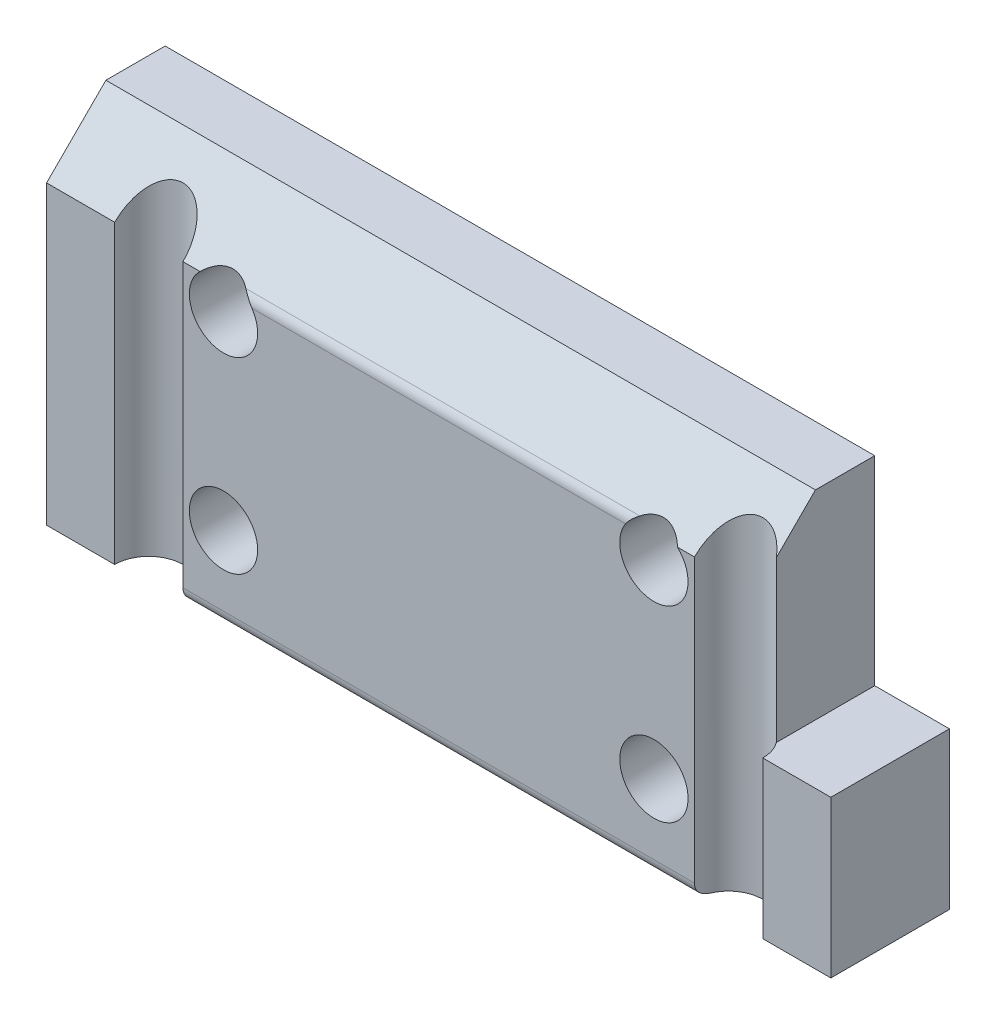
ISO-10303-21;
HEADER;
FILE_DESCRIPTION(('STEP AP214'),'2;1');
FILE_NAME('part.step','',(''),(''),'','','');
FILE_SCHEMA(('AUTOMOTIVE_DESIGN { 1 0 10303 214 1 1 1 1 }'));
ENDSEC;
DATA;
#1=APPLICATION_CONTEXT('core data for automotive mechanical design processes');
#2=APPLICATION_PROTOCOL_DEFINITION('international standard','automotive_design',2000,#1);
#3=PRODUCT_CONTEXT('',#1,'mechanical');
#4=PRODUCT('Part','Part','',(#3));
#5=PRODUCT_RELATED_PRODUCT_CATEGORY('part','',(#4));
#6=PRODUCT_DEFINITION_FORMATION('','',#4);
#7=PRODUCT_DEFINITION_CONTEXT('part definition',#1,'design');
#8=PRODUCT_DEFINITION('design','',#6,#7);
#9=PRODUCT_DEFINITION_SHAPE('','',#8);
#10=(LENGTH_UNIT() NAMED_UNIT(*) SI_UNIT(.MILLI.,.METRE.));
#11=(NAMED_UNIT(*) PLANE_ANGLE_UNIT() SI_UNIT($,.RADIAN.));
#12=(NAMED_UNIT(*) SI_UNIT($,.STERADIAN.) SOLID_ANGLE_UNIT());
#13=UNCERTAINTY_MEASURE_WITH_UNIT(LENGTH_MEASURE(1.E-05),#10,'distance_accuracy_value','');
#14=(GEOMETRIC_REPRESENTATION_CONTEXT(3) GLOBAL_UNCERTAINTY_ASSIGNED_CONTEXT((#13)) GLOBAL_UNIT_ASSIGNED_CONTEXT((#10,
#11,#12)) REPRESENTATION_CONTEXT('',''));
#15=CARTESIAN_POINT('',(0.,0.,0.));
#16=DIRECTION('',(0.,0.,1.));
#17=DIRECTION('',(1.,0.,0.));
#18=AXIS2_PLACEMENT_3D('',#15,#16,#17);
#19=CARTESIAN_POINT('',(21.,6.34999999999997,0.));
#20=DIRECTION('',(0.,0.,-1.));
#21=DIRECTION('',(0.,1.,0.));
#22=AXIS2_PLACEMENT_3D('',#19,#20,#21);
#23=PLANE('',#22);
#24=DIRECTION('',(0.,-1.,0.));
#25=VECTOR('',#24,1.);
#26=CARTESIAN_POINT('',(21.,6.34999999999997,0.));
#27=LINE('',#26,#25);
#28=CARTESIAN_POINT('',(21.,-1.143,0.));
#29=VERTEX_POINT('',#28);
#30=CARTESIAN_POINT('',(21.,-9.525,0.));
#31=VERTEX_POINT('',#30);
#32=EDGE_CURVE('E166',#29,#31,#27,.T.);
#33=ORIENTED_EDGE('',*,*,#32,.F.);
#34=DIRECTION('',(-1.,0.,0.));
#35=VECTOR('',#34,1.);
#36=CARTESIAN_POINT('',(21.,-1.143,0.));
#37=LINE('',#36,#35);
#38=CARTESIAN_POINT('',(17.3538,-1.143,0.));
#39=VERTEX_POINT('',#38);
#40=EDGE_CURVE('E152',#29,#39,#37,.T.);
#41=ORIENTED_EDGE('',*,*,#40,.T.);
#42=DIRECTION('',(0.,-1.,0.));
#43=VECTOR('',#42,1.);
#44=CARTESIAN_POINT('',(17.3538,-9.525,0.));
#45=LINE('',#44,#43);
#46=CARTESIAN_POINT('',(17.3538,-9.525,0.));
#47=VERTEX_POINT('',#46);
#48=EDGE_CURVE('E411',#39,#47,#45,.T.);
#49=ORIENTED_EDGE('',*,*,#48,.T.);
#50=DIRECTION('',(-1.,0.,0.));
#51=VECTOR('',#50,1.);
#52=CARTESIAN_POINT('',(21.,-9.525,0.));
#53=LINE('',#52,#51);
#54=EDGE_CURVE('E172',#31,#47,#53,.T.);
#55=ORIENTED_EDGE('',*,*,#54,.F.);
#56=EDGE_LOOP('',(#33,#41,#49,#55));
#57=FACE_BOUND('',#56,.T.);
#58=ADVANCED_FACE('F45',(#57),#23,.F.);
#59=CARTESIAN_POINT('',(-11.525,-5.025,0.));
#60=DIRECTION('',(0.,0.,-1.));
#61=DIRECTION('',(0.,1.,0.));
#62=AXIS2_PLACEMENT_3D('',#59,#60,#61);
#63=CIRCLE('',#62,1.8288);
#64=CARTESIAN_POINT('',(-11.525,-3.1962,0.));
#65=VERTEX_POINT('',#64);
#66=EDGE_CURVE('E186',#65,#65,#63,.T.);
#67=ORIENTED_EDGE('',*,*,#66,.T.);
#68=EDGE_LOOP('',(#67));
#69=FACE_BOUND('',#68,.T.);
#70=CARTESIAN_POINT('',(11.525,-5.025,0.));
#71=DIRECTION('',(0.,0.,-1.));
#72=DIRECTION('',(0.,1.,0.));
#73=AXIS2_PLACEMENT_3D('',#70,#71,#72);
#74=CIRCLE('',#73,1.8288);
#75=CARTESIAN_POINT('',(11.525,-3.1962,0.));
#76=VERTEX_POINT('',#75);
#77=EDGE_CURVE('E216',#76,#76,#74,.T.);
#78=ORIENTED_EDGE('',*,*,#77,.T.);
#79=EDGE_LOOP('',(#78));
#80=FACE_BOUND('',#79,.T.);
#81=CARTESIAN_POINT('',(11.525,5.025,0.));
#82=DIRECTION('',(0.,0.,-1.));
#83=DIRECTION('',(0.,1.,0.));
#84=AXIS2_PLACEMENT_3D('',#81,#82,#83);
#85=CIRCLE('',#84,1.8288);
#86=CARTESIAN_POINT('',(12.7855095953622,6.34999999999997,0.));
#87=VERTEX_POINT('',#86);
#88=CARTESIAN_POINT('',(10.003282498988,6.03933982822015,0.));
#89=VERTEX_POINT('',#88);
#90=EDGE_CURVE('E437',#87,#89,#85,.T.);
#91=ORIENTED_EDGE('',*,*,#90,.T.);
#92=DIRECTION('',(-1.,0.,0.));
#93=VECTOR('',#92,1.);
#94=CARTESIAN_POINT('',(21.,6.03933982822015,0.));
#95=LINE('',#94,#93);
#96=CARTESIAN_POINT('',(-10.003282498988,6.03933982822015,0.));
#97=VERTEX_POINT('',#96);
#98=EDGE_CURVE('E229',#89,#97,#95,.T.);
#99=ORIENTED_EDGE('',*,*,#98,.T.);
#100=CARTESIAN_POINT('',(-11.525,5.025,0.));
#101=DIRECTION('',(0.,0.,-1.));
#102=DIRECTION('',(0.,1.,0.));
#103=AXIS2_PLACEMENT_3D('',#100,#101,#102);
#104=CIRCLE('',#103,1.8288);
#105=CARTESIAN_POINT('',(-12.7855095953621,6.34999999999997,0.));
#106=VERTEX_POINT('',#105);
#107=EDGE_CURVE('E456',#97,#106,#104,.T.);
#108=ORIENTED_EDGE('',*,*,#107,.T.);
#109=DIRECTION('',(-1.,0.,0.));
#110=VECTOR('',#109,1.);
#111=CARTESIAN_POINT('',(21.,6.34999999999997,0.));
#112=LINE('',#111,#110);
#113=CARTESIAN_POINT('',(-13.6962,6.34999999999997,0.));
#114=VERTEX_POINT('',#113);
#115=EDGE_CURVE('E205',#106,#114,#112,.T.);
#116=ORIENTED_EDGE('',*,*,#115,.T.);
#117=DIRECTION('',(0.,-1.,0.));
#118=VECTOR('',#117,1.);
#119=CARTESIAN_POINT('',(-13.6962,-9.525,0.));
#120=LINE('',#119,#118);
#121=CARTESIAN_POINT('',(-13.6962,-8.775,0.));
#122=VERTEX_POINT('',#121);
#123=EDGE_CURVE('E425',#114,#122,#120,.T.);
#124=ORIENTED_EDGE('',*,*,#123,.T.);
#125=DIRECTION('',(-1.,0.,0.));
#126=VECTOR('',#125,1.);
#127=CARTESIAN_POINT('',(21.,-8.775,0.));
#128=LINE('',#127,#126);
#129=CARTESIAN_POINT('',(13.6962,-8.775,0.));
#130=VERTEX_POINT('',#129);
#131=EDGE_CURVE('E227',#122,#130,#128,.F.);
#132=ORIENTED_EDGE('',*,*,#131,.T.);
#133=DIRECTION('',(0.,-1.,0.));
#134=VECTOR('',#133,1.);
#135=CARTESIAN_POINT('',(13.6962,-9.525,0.));
#136=LINE('',#135,#134);
#137=CARTESIAN_POINT('',(13.6962,6.34999999999997,0.));
#138=VERTEX_POINT('',#137);
#139=EDGE_CURVE('E415',#130,#138,#136,.F.);
#140=ORIENTED_EDGE('',*,*,#139,.T.);
#141=EDGE_CURVE('E201',#138,#87,#112,.T.);
#142=ORIENTED_EDGE('',*,*,#141,.T.);
#143=EDGE_LOOP('',(#91,#99,#108,#116,#124,#132,#140,#142));
#144=FACE_BOUND('',#143,.T.);
#145=ADVANCED_FACE('F279',(#69,#80,#144),#23,.F.);
#146=CARTESIAN_POINT('',(21.,9.525,-6.35));
#147=DIRECTION('',(0.,0.,1.));
#148=DIRECTION('',(1.,0.,0.));
#149=AXIS2_PLACEMENT_3D('',#146,#147,#148);
#150=PLANE('',#149);
#151=CARTESIAN_POINT('',(11.525,5.025,-6.35));
#152=DIRECTION('',(0.,0.,-1.));
#153=DIRECTION('',(-1.,0.,0.));
#154=AXIS2_PLACEMENT_3D('',#151,#152,#153);
#155=CIRCLE('',#154,3.57251);
#156=CARTESIAN_POINT('',(7.95249,5.025,-6.35));
#157=VERTEX_POINT('',#156);
#158=EDGE_CURVE('E428',#157,#157,#155,.T.);
#159=ORIENTED_EDGE('',*,*,#158,.F.);
#160=EDGE_LOOP('',(#159));
#161=FACE_BOUND('',#160,.T.);
#162=CARTESIAN_POINT('',(11.525,-5.025,-6.35));
#163=DIRECTION('',(0.,0.,-1.));
#164=DIRECTION('',(-1.,0.,0.));
#165=AXIS2_PLACEMENT_3D('',#162,#163,#164);
#166=CIRCLE('',#165,3.57251);
#167=CARTESIAN_POINT('',(7.95249,-5.025,-6.35));
#168=VERTEX_POINT('',#167);
#169=EDGE_CURVE('E440',#168,#168,#166,.T.);
#170=ORIENTED_EDGE('',*,*,#169,.F.);
#171=EDGE_LOOP('',(#170));
#172=FACE_BOUND('',#171,.T.);
#173=CARTESIAN_POINT('',(-11.525,5.025,-6.35));
#174=DIRECTION('',(0.,0.,-1.));
#175=DIRECTION('',(-1.,0.,0.));
#176=AXIS2_PLACEMENT_3D('',#173,#174,#175);
#177=CIRCLE('',#176,3.57251);
#178=CARTESIAN_POINT('',(-15.09751,5.025,-6.35));
#179=VERTEX_POINT('',#178);
#180=EDGE_CURVE('E219',#179,#179,#177,.T.);
#181=ORIENTED_EDGE('',*,*,#180,.F.);
#182=EDGE_LOOP('',(#181));
#183=FACE_BOUND('',#182,.T.);
#184=CARTESIAN_POINT('',(-11.525,-5.025,-6.35));
#185=DIRECTION('',(0.,0.,-1.));
#186=DIRECTION('',(-1.,0.,0.));
#187=AXIS2_PLACEMENT_3D('',#184,#185,#186);
#188=CIRCLE('',#187,3.57251);
#189=CARTESIAN_POINT('',(-15.09751,-5.025,-6.35));
#190=VERTEX_POINT('',#189);
#191=EDGE_CURVE('E458',#190,#190,#188,.T.);
#192=ORIENTED_EDGE('',*,*,#191,.F.);
#193=EDGE_LOOP('',(#192));
#194=FACE_BOUND('',#193,.T.);
#195=DIRECTION('',(-1.,0.,0.));
#196=VECTOR('',#195,1.);
#197=CARTESIAN_POINT('',(21.,9.525,-6.35));
#198=LINE('',#197,#196);
#199=CARTESIAN_POINT('',(17.,9.525,-6.35));
#200=VERTEX_POINT('',#199);
#201=CARTESIAN_POINT('',(-21.,9.525,-6.35));
#202=VERTEX_POINT('',#201);
#203=EDGE_CURVE('E207',#200,#202,#198,.T.);
#204=ORIENTED_EDGE('',*,*,#203,.F.);
#205=DIRECTION('',(0.,1.,0.));
#206=VECTOR('',#205,1.);
#207=CARTESIAN_POINT('',(17.,9.525,-6.35));
#208=LINE('',#207,#206);
#209=CARTESIAN_POINT('',(17.,-1.143,-6.35));
#210=VERTEX_POINT('',#209);
#211=EDGE_CURVE('E161',#210,#200,#208,.T.);
#212=ORIENTED_EDGE('',*,*,#211,.F.);
#213=DIRECTION('',(-1.,0.,0.));
#214=VECTOR('',#213,1.);
#215=CARTESIAN_POINT('',(21.,-1.143,-6.35));
#216=LINE('',#215,#214);
#217=CARTESIAN_POINT('',(21.,-1.143,-6.35));
#218=VERTEX_POINT('',#217);
#219=EDGE_CURVE('E491',#218,#210,#216,.T.);
#220=ORIENTED_EDGE('',*,*,#219,.F.);
#221=DIRECTION('',(0.,1.,0.));
#222=VECTOR('',#221,1.);
#223=CARTESIAN_POINT('',(21.,9.525,-6.35));
#224=LINE('',#223,#222);
#225=CARTESIAN_POINT('',(21.,-9.525,-6.35));
#226=VERTEX_POINT('',#225);
#227=EDGE_CURVE('E169',#226,#218,#224,.T.);
#228=ORIENTED_EDGE('',*,*,#227,.F.);
#229=DIRECTION('',(-1.,0.,0.));
#230=VECTOR('',#229,1.);
#231=CARTESIAN_POINT('',(21.,-9.525,-6.35));
#232=LINE('',#231,#230);
#233=CARTESIAN_POINT('',(-21.,-9.525,-6.35));
#234=VERTEX_POINT('',#233);
#235=EDGE_CURVE('E176',#226,#234,#232,.T.);
#236=ORIENTED_EDGE('',*,*,#235,.T.);
#237=DIRECTION('',(0.,1.,0.));
#238=VECTOR('',#237,1.);
#239=CARTESIAN_POINT('',(-21.,9.525,-6.35));
#240=LINE('',#239,#238);
#241=EDGE_CURVE('E182',#234,#202,#240,.T.);
#242=ORIENTED_EDGE('',*,*,#241,.T.);
#243=EDGE_LOOP('',(#204,#212,#220,#228,#236,#242));
#244=FACE_BOUND('',#243,.T.);
#245=ADVANCED_FACE('F285',(#161,#172,#183,#194,#244),#150,.F.);
#246=CARTESIAN_POINT('',(21.,9.525,-3.175));
#247=DIRECTION('',(0.,-1.,0.));
#248=DIRECTION('',(0.,0.,-1.));
#249=AXIS2_PLACEMENT_3D('',#246,#247,#248);
#250=PLANE('',#249);
#251=DIRECTION('',(-1.,0.,0.));
#252=VECTOR('',#251,1.);
#253=CARTESIAN_POINT('',(21.,9.525,-3.175));
#254=LINE('',#253,#252);
#255=CARTESIAN_POINT('',(17.,9.525,-3.175));
#256=VERTEX_POINT('',#255);
#257=CARTESIAN_POINT('',(-21.,9.525,-3.175));
#258=VERTEX_POINT('',#257);
#259=EDGE_CURVE('E204',#256,#258,#254,.T.);
#260=ORIENTED_EDGE('',*,*,#259,.F.);
#261=DIRECTION('',(0.,0.,-1.));
#262=VECTOR('',#261,1.);
#263=CARTESIAN_POINT('',(17.,9.525,0.));
#264=LINE('',#263,#262);
#265=EDGE_CURVE('E479',#256,#200,#264,.T.);
#266=ORIENTED_EDGE('',*,*,#265,.T.);
#267=ORIENTED_EDGE('',*,*,#203,.T.);
#268=DIRECTION('',(0.,0.,1.));
#269=VECTOR('',#268,1.);
#270=CARTESIAN_POINT('',(-21.,9.525,-3.175));
#271=LINE('',#270,#269);
#272=EDGE_CURVE('E185',#202,#258,#271,.T.);
#273=ORIENTED_EDGE('',*,*,#272,.T.);
#274=EDGE_LOOP('',(#260,#266,#267,#273));
#275=FACE_BOUND('',#274,.T.);
#276=ADVANCED_FACE('F282',(#275),#250,.F.);
#277=CARTESIAN_POINT('',(21.,6.34999999999997,0.));
#278=DIRECTION('',(0.,-0.707106781186544,-0.707106781186551));
#279=DIRECTION('',(0.,0.707106781186551,-0.707106781186544));
#280=AXIS2_PLACEMENT_3D('',#277,#278,#279);
#281=PLANE('',#280);
#282=CARTESIAN_POINT('',(15.525,6.34999999999997,0.));
#283=DIRECTION('',(0.,-0.707106781186544,-0.707106781186551));
#284=DIRECTION('',(0.,-0.707106781186551,0.707106781186544));
#285=AXIS2_PLACEMENT_3D('',#282,#283,#284);
#286=ELLIPSE('',#285,2.58631376286792,1.82879999999999);
#287=CARTESIAN_POINT('',(17.,7.43114959186966,-1.08114959186968));
#288=VERTEX_POINT('',#287);
#289=EDGE_CURVE('E224',#138,#288,#286,.T.);
#290=ORIENTED_EDGE('',*,*,#289,.T.);
#291=DIRECTION('',(0.,0.707106781186551,-0.707106781186544));
#292=VECTOR('',#291,1.);
#293=CARTESIAN_POINT('',(17.,6.34999999999997,0.));
#294=LINE('',#293,#292);
#295=EDGE_CURVE('E484',#288,#256,#294,.T.);
#296=ORIENTED_EDGE('',*,*,#295,.T.);
#297=ORIENTED_EDGE('',*,*,#259,.T.);
#298=DIRECTION('',(0.,-0.707106781186551,0.707106781186544));
#299=VECTOR('',#298,1.);
#300=CARTESIAN_POINT('',(-21.,6.34999999999997,0.));
#301=LINE('',#300,#299);
#302=CARTESIAN_POINT('',(-21.,6.34999999999997,0.));
#303=VERTEX_POINT('',#302);
#304=EDGE_CURVE('E189',#258,#303,#301,.T.);
#305=ORIENTED_EDGE('',*,*,#304,.T.);
#306=CARTESIAN_POINT('',(-17.3538,6.34999999999997,0.));
#307=VERTEX_POINT('',#306);
#308=EDGE_CURVE('E200',#307,#303,#112,.T.);
#309=ORIENTED_EDGE('',*,*,#308,.F.);
#310=CARTESIAN_POINT('',(-15.525,6.34999999999997,0.));
#311=DIRECTION('',(0.,-0.707106781186544,-0.707106781186551));
#312=DIRECTION('',(0.,-0.707106781186551,0.707106781186544));
#313=AXIS2_PLACEMENT_3D('',#310,#311,#312);
#314=ELLIPSE('',#313,2.58631376286792,1.82879999999999);
#315=EDGE_CURVE('E418',#307,#114,#314,.T.);
#316=ORIENTED_EDGE('',*,*,#315,.T.);
#317=ORIENTED_EDGE('',*,*,#115,.F.);
#318=CARTESIAN_POINT('',(-11.525,5.025,1.32499999999995));
#319=DIRECTION('',(0.,-0.707106781186544,-0.707106781186551));
#320=DIRECTION('',(0.,0.707106781186551,-0.707106781186544));
#321=AXIS2_PLACEMENT_3D('',#318,#319,#320);
#322=ELLIPSE('',#321,2.5863137628679,1.8288);
#323=CARTESIAN_POINT('',(-10.5459676734432,6.56966991411005,-0.219669914110086));
#324=VERTEX_POINT('',#323);
#325=EDGE_CURVE('E209',#106,#324,#322,.T.);
#326=ORIENTED_EDGE('',*,*,#325,.T.);
#327=DIRECTION('',(-1.,0.,0.));
#328=VECTOR('',#327,1.);
#329=CARTESIAN_POINT('',(21.,6.56966991411005,-0.219669914110086));
#330=LINE('',#329,#328);
#331=CARTESIAN_POINT('',(10.5459676734432,6.56966991411005,-0.219669914110086));
#332=VERTEX_POINT('',#331);
#333=EDGE_CURVE('E239',#324,#332,#330,.F.);
#334=ORIENTED_EDGE('',*,*,#333,.T.);
#335=CARTESIAN_POINT('',(11.525,5.025,1.32499999999995));
#336=DIRECTION('',(0.,-0.707106781186544,-0.707106781186551));
#337=DIRECTION('',(0.,0.707106781186551,-0.707106781186544));
#338=AXIS2_PLACEMENT_3D('',#335,#336,#337);
#339=ELLIPSE('',#338,2.5863137628679,1.8288);
#340=EDGE_CURVE('E215',#332,#87,#339,.T.);
#341=ORIENTED_EDGE('',*,*,#340,.T.);
#342=ORIENTED_EDGE('',*,*,#141,.F.);
#343=EDGE_LOOP('',(#290,#296,#297,#305,#309,#316,#317,#326,#334,#341,#342));
#344=FACE_BOUND('',#343,.T.);
#345=ADVANCED_FACE('F277',(#344),#281,.F.);
#346=CARTESIAN_POINT('',(-17.3538,-9.525,0.));
#347=VERTEX_POINT('',#346);
#348=CARTESIAN_POINT('',(-21.,-9.525,0.));
#349=VERTEX_POINT('',#348);
#350=EDGE_CURVE('E198',#347,#349,#53,.T.);
#351=ORIENTED_EDGE('',*,*,#350,.F.);
#352=DIRECTION('',(0.,-1.,0.));
#353=VECTOR('',#352,1.);
#354=CARTESIAN_POINT('',(-17.3538,-9.525,0.));
#355=LINE('',#354,#353);
#356=EDGE_CURVE('E414',#347,#307,#355,.F.);
#357=ORIENTED_EDGE('',*,*,#356,.T.);
#358=ORIENTED_EDGE('',*,*,#308,.T.);
#359=DIRECTION('',(0.,-1.,0.));
#360=VECTOR('',#359,1.);
#361=CARTESIAN_POINT('',(-21.,6.34999999999997,0.));
#362=LINE('',#361,#360);
#363=EDGE_CURVE('E192',#303,#349,#362,.T.);
#364=ORIENTED_EDGE('',*,*,#363,.T.);
#365=EDGE_LOOP('',(#351,#357,#358,#364));
#366=FACE_BOUND('',#365,.T.);
#367=ADVANCED_FACE('F273',(#366),#23,.F.);
#368=CARTESIAN_POINT('',(21.,-9.525,0.));
#369=DIRECTION('',(0.,1.,0.));
#370=DIRECTION('',(0.,0.,1.));
#371=AXIS2_PLACEMENT_3D('',#368,#369,#370);
#372=PLANE('',#371);
#373=CARTESIAN_POINT('',(15.525,-9.525,0.));
#374=DIRECTION('',(0.,-1.,0.));
#375=DIRECTION('',(0.,0.,-1.));
#376=AXIS2_PLACEMENT_3D('',#373,#374,#375);
#377=CIRCLE('',#376,1.82879999999999);
#378=CARTESIAN_POINT('',(13.8570643177868,-9.525,-0.750000000000002));
#379=VERTEX_POINT('',#378);
#380=EDGE_CURVE('E413',#379,#47,#377,.T.);
#381=ORIENTED_EDGE('',*,*,#380,.F.);
#382=DIRECTION('',(-1.,0.,0.));
#383=VECTOR('',#382,1.);
#384=CARTESIAN_POINT('',(21.,-9.525,-0.750000000000002));
#385=LINE('',#384,#383);
#386=CARTESIAN_POINT('',(-13.8570643177868,-9.525,-0.750000000000002));
#387=VERTEX_POINT('',#386);
#388=EDGE_CURVE('E502',#379,#387,#385,.T.);
#389=ORIENTED_EDGE('',*,*,#388,.T.);
#390=CARTESIAN_POINT('',(-15.525,-9.525,0.));
#391=DIRECTION('',(0.,1.,0.));
#392=DIRECTION('',(0.,0.,1.));
#393=AXIS2_PLACEMENT_3D('',#390,#391,#392);
#394=CIRCLE('',#393,1.82879999999999);
#395=EDGE_CURVE('E222',#387,#347,#394,.T.);
#396=ORIENTED_EDGE('',*,*,#395,.T.);
#397=ORIENTED_EDGE('',*,*,#350,.T.);
#398=DIRECTION('',(0.,0.,-1.));
#399=VECTOR('',#398,1.);
#400=CARTESIAN_POINT('',(-21.,-9.525,0.));
#401=LINE('',#400,#399);
#402=EDGE_CURVE('E178',#349,#234,#401,.T.);
#403=ORIENTED_EDGE('',*,*,#402,.T.);
#404=ORIENTED_EDGE('',*,*,#235,.F.);
#405=DIRECTION('',(0.,0.,-1.));
#406=VECTOR('',#405,1.);
#407=CARTESIAN_POINT('',(21.,-9.525,0.));
#408=LINE('',#407,#406);
#409=EDGE_CURVE('E174',#31,#226,#408,.T.);
#410=ORIENTED_EDGE('',*,*,#409,.F.);
#411=ORIENTED_EDGE('',*,*,#54,.T.);
#412=EDGE_LOOP('',(#381,#389,#396,#397,#403,#404,#410,#411));
#413=FACE_BOUND('',#412,.T.);
#414=ADVANCED_FACE('F267',(#413),#372,.F.);
#415=CARTESIAN_POINT('',(21.,0.,0.));
#416=DIRECTION('',(1.,0.,0.));
#417=DIRECTION('',(0.,0.,-1.));
#418=AXIS2_PLACEMENT_3D('',#415,#416,#417);
#419=PLANE('',#418);
#420=DIRECTION('',(0.,0.,-1.));
#421=VECTOR('',#420,1.);
#422=CARTESIAN_POINT('',(21.,-1.143,0.));
#423=LINE('',#422,#421);
#424=EDGE_CURVE('E155',#29,#218,#423,.T.);
#425=ORIENTED_EDGE('',*,*,#424,.F.);
#426=ORIENTED_EDGE('',*,*,#32,.T.);
#427=ORIENTED_EDGE('',*,*,#409,.T.);
#428=ORIENTED_EDGE('',*,*,#227,.T.);
#429=EDGE_LOOP('',(#425,#426,#427,#428));
#430=FACE_BOUND('',#429,.T.);
#431=ADVANCED_FACE('F165',(#430),#419,.T.);
#432=CARTESIAN_POINT('',(-21.,0.,0.));
#433=DIRECTION('',(1.,0.,0.));
#434=DIRECTION('',(0.,0.,-1.));
#435=AXIS2_PLACEMENT_3D('',#432,#433,#434);
#436=PLANE('',#435);
#437=ORIENTED_EDGE('',*,*,#241,.F.);
#438=ORIENTED_EDGE('',*,*,#402,.F.);
#439=ORIENTED_EDGE('',*,*,#363,.F.);
#440=ORIENTED_EDGE('',*,*,#304,.F.);
#441=ORIENTED_EDGE('',*,*,#272,.F.);
#442=EDGE_LOOP('',(#437,#438,#439,#440,#441));
#443=FACE_BOUND('',#442,.T.);
#444=ADVANCED_FACE('F263',(#443),#436,.F.);
#445=CARTESIAN_POINT('',(-11.525,-5.025,-6.35));
#446=DIRECTION('',(0.,0.,-1.));
#447=DIRECTION('',(-1.,0.,0.));
#448=AXIS2_PLACEMENT_3D('',#445,#446,#447);
#449=CYLINDRICAL_SURFACE('',#448,1.8288);
#450=CARTESIAN_POINT('',(-11.525,-5.025,-3.81));
#451=DIRECTION('',(0.,0.,-1.));
#452=DIRECTION('',(-1.,0.,0.));
#453=AXIS2_PLACEMENT_3D('',#450,#451,#452);
#454=CIRCLE('',#453,1.8288);
#455=CARTESIAN_POINT('',(-13.3538,-5.025,-3.81));
#456=VERTEX_POINT('',#455);
#457=EDGE_CURVE('E212',#456,#456,#454,.T.);
#458=ORIENTED_EDGE('',*,*,#457,.T.);
#459=EDGE_LOOP('',(#458));
#460=FACE_BOUND('',#459,.T.);
#461=ORIENTED_EDGE('',*,*,#66,.F.);
#462=EDGE_LOOP('',(#461));
#463=FACE_BOUND('',#462,.T.);
#464=ADVANCED_FACE('F259',(#460,#463),#449,.F.);
#465=CARTESIAN_POINT('',(-9.6962,-5.025,-3.81));
#466=DIRECTION('',(0.,0.,1.));
#467=DIRECTION('',(1.,0.,0.));
#468=AXIS2_PLACEMENT_3D('',#465,#466,#467);
#469=PLANE('',#468);
#470=ORIENTED_EDGE('',*,*,#457,.F.);
#471=EDGE_LOOP('',(#470));
#472=FACE_BOUND('',#471,.T.);
#473=CARTESIAN_POINT('',(-11.525,-5.025,-3.81));
#474=DIRECTION('',(0.,0.,-1.));
#475=DIRECTION('',(-1.,0.,0.));
#476=AXIS2_PLACEMENT_3D('',#473,#474,#475);
#477=CIRCLE('',#476,3.57251);
#478=CARTESIAN_POINT('',(-15.09751,-5.025,-3.81));
#479=VERTEX_POINT('',#478);
#480=EDGE_CURVE('E461',#479,#479,#477,.T.);
#481=ORIENTED_EDGE('',*,*,#480,.T.);
#482=EDGE_LOOP('',(#481));
#483=FACE_BOUND('',#482,.T.);
#484=ADVANCED_FACE('F255',(#472,#483),#469,.F.);
#485=CARTESIAN_POINT('',(-11.525,-5.025,-6.35));
#486=DIRECTION('',(0.,0.,-1.));
#487=DIRECTION('',(-1.,0.,0.));
#488=AXIS2_PLACEMENT_3D('',#485,#486,#487);
#489=CYLINDRICAL_SURFACE('',#488,3.57251);
#490=ORIENTED_EDGE('',*,*,#480,.F.);
#491=EDGE_LOOP('',(#490));
#492=FACE_BOUND('',#491,.T.);
#493=ORIENTED_EDGE('',*,*,#191,.T.);
#494=EDGE_LOOP('',(#493));
#495=FACE_BOUND('',#494,.T.);
#496=ADVANCED_FACE('F250',(#492,#495),#489,.F.);
#497=CARTESIAN_POINT('',(-11.525,5.025,-6.35));
#498=DIRECTION('',(0.,0.,-1.));
#499=DIRECTION('',(-1.,0.,0.));
#500=AXIS2_PLACEMENT_3D('',#497,#498,#499);
#501=CYLINDRICAL_SURFACE('',#500,1.8288);
#502=CARTESIAN_POINT('',(-11.525,5.025,-3.81));
#503=DIRECTION('',(0.,0.,-1.));
#504=DIRECTION('',(-1.,0.,0.));
#505=AXIS2_PLACEMENT_3D('',#502,#503,#504);
#506=CIRCLE('',#505,1.8288);
#507=CARTESIAN_POINT('',(-13.3538,5.025,-3.81));
#508=VERTEX_POINT('',#507);
#509=EDGE_CURVE('E453',#508,#508,#506,.T.);
#510=ORIENTED_EDGE('',*,*,#509,.T.);
#511=EDGE_LOOP('',(#510));
#512=FACE_BOUND('',#511,.T.);
#513=ORIENTED_EDGE('',*,*,#107,.F.);
#514=CARTESIAN_POINT('',(-10.003282498988,6.03933982822015,0.));
#515=CARTESIAN_POINT('',(-10.0212425116719,6.06629310091701,-2.51963735137379E-06));
#516=CARTESIAN_POINT('',(-10.039906569203,6.09273169935019,-0.00145194159973826));
#517=CARTESIAN_POINT('',(-10.0784355436853,6.14437136449561,-0.00693751081503247));
#518=CARTESIAN_POINT('',(-10.0982982703906,6.1695745444536,-0.0109690622338227));
#519=CARTESIAN_POINT('',(-10.1585236794229,6.24201720270355,-0.0262452808843103));
#520=CARTESIAN_POINT('',(-10.2003767281767,6.28735765680942,-0.0407023770406283));
#521=CARTESIAN_POINT('',(-10.290887736311,6.37624977408328,-0.0780376978265578));
#522=CARTESIAN_POINT('',(-10.33981603488,6.41923750512854,-0.10157707888605));
#523=CARTESIAN_POINT('',(-10.4153528123583,6.47905042802878,-0.141926972723033));
#524=CARTESIAN_POINT('',(-10.4412368721027,6.49842768153044,-0.156438094186994));
#525=CARTESIAN_POINT('',(-10.4933629775369,6.53538195845011,-0.186960539075912));
#526=CARTESIAN_POINT('',(-10.5196046917041,6.55296053551931,-0.20297054451296));
#527=CARTESIAN_POINT('',(-10.5459676734432,6.56966991411005,-0.219669914110086));
#528=B_SPLINE_CURVE_WITH_KNOTS('',3,(#514,#515,#516,#517,#518,#519,#520,#521,#522,#523,#524,
#525,#526,#527),.UNSPECIFIED.,.F.,.F.,(4,2,2,2,2,2,4),(0.,0.0970628040756524,0.193953328035096,
0.383217256416149,0.590182939042233,0.696438937202257,0.802602365263823),.UNSPECIFIED.);
#529=EDGE_CURVE('E232',#97,#324,#528,.T.);
#530=ORIENTED_EDGE('',*,*,#529,.T.);
#531=ORIENTED_EDGE('',*,*,#325,.F.);
#532=EDGE_LOOP('',(#513,#530,#531));
#533=FACE_BOUND('',#532,.T.);
#534=ADVANCED_FACE('F244',(#512,#533),#501,.F.);
#535=CARTESIAN_POINT('',(-9.6962,5.025,-3.81));
#536=DIRECTION('',(0.,0.,1.));
#537=DIRECTION('',(1.,0.,0.));
#538=AXIS2_PLACEMENT_3D('',#535,#536,#537);
#539=PLANE('',#538);
#540=ORIENTED_EDGE('',*,*,#509,.F.);
#541=EDGE_LOOP('',(#540));
#542=FACE_BOUND('',#541,.T.);
#543=CARTESIAN_POINT('',(-11.525,5.025,-3.81));
#544=DIRECTION('',(0.,0.,-1.));
#545=DIRECTION('',(-1.,0.,0.));
#546=AXIS2_PLACEMENT_3D('',#543,#544,#545);
#547=CIRCLE('',#546,3.57251);
#548=CARTESIAN_POINT('',(-15.09751,5.025,-3.81));
#549=VERTEX_POINT('',#548);
#550=EDGE_CURVE('E450',#549,#549,#547,.T.);
#551=ORIENTED_EDGE('',*,*,#550,.T.);
#552=EDGE_LOOP('',(#551));
#553=FACE_BOUND('',#552,.T.);
#554=ADVANCED_FACE('F249',(#542,#553),#539,.F.);
#555=CARTESIAN_POINT('',(-11.525,5.025,-6.35));
#556=DIRECTION('',(0.,0.,-1.));
#557=DIRECTION('',(-1.,0.,0.));
#558=AXIS2_PLACEMENT_3D('',#555,#556,#557);
#559=CYLINDRICAL_SURFACE('',#558,3.57251);
#560=ORIENTED_EDGE('',*,*,#550,.F.);
#561=EDGE_LOOP('',(#560));
#562=FACE_BOUND('',#561,.T.);
#563=ORIENTED_EDGE('',*,*,#180,.T.);
#564=EDGE_LOOP('',(#563));
#565=FACE_BOUND('',#564,.T.);
#566=ADVANCED_FACE('F519',(#562,#565),#559,.F.);
#567=CARTESIAN_POINT('',(11.525,-5.025,-6.35));
#568=DIRECTION('',(0.,0.,-1.));
#569=DIRECTION('',(-1.,0.,0.));
#570=AXIS2_PLACEMENT_3D('',#567,#568,#569);
#571=CYLINDRICAL_SURFACE('',#570,1.8288);
#572=CARTESIAN_POINT('',(11.525,-5.025,-3.81));
#573=DIRECTION('',(0.,0.,-1.));
#574=DIRECTION('',(-1.,0.,0.));
#575=AXIS2_PLACEMENT_3D('',#572,#573,#574);
#576=CIRCLE('',#575,1.8288);
#577=CARTESIAN_POINT('',(9.6962,-5.025,-3.81));
#578=VERTEX_POINT('',#577);
#579=EDGE_CURVE('E220',#578,#578,#576,.T.);
#580=ORIENTED_EDGE('',*,*,#579,.T.);
#581=EDGE_LOOP('',(#580));
#582=FACE_BOUND('',#581,.T.);
#583=ORIENTED_EDGE('',*,*,#77,.F.);
#584=EDGE_LOOP('',(#583));
#585=FACE_BOUND('',#584,.T.);
#586=ADVANCED_FACE('F516',(#582,#585),#571,.F.);
#587=CARTESIAN_POINT('',(13.3538,-5.025,-3.81));
#588=DIRECTION('',(0.,0.,1.));
#589=DIRECTION('',(1.,0.,0.));
#590=AXIS2_PLACEMENT_3D('',#587,#588,#589);
#591=PLANE('',#590);
#592=ORIENTED_EDGE('',*,*,#579,.F.);
#593=EDGE_LOOP('',(#592));
#594=FACE_BOUND('',#593,.T.);
#595=CARTESIAN_POINT('',(11.525,-5.025,-3.81));
#596=DIRECTION('',(0.,0.,-1.));
#597=DIRECTION('',(-1.,0.,0.));
#598=AXIS2_PLACEMENT_3D('',#595,#596,#597);
#599=CIRCLE('',#598,3.57251);
#600=CARTESIAN_POINT('',(7.95249,-5.025,-3.81));
#601=VERTEX_POINT('',#600);
#602=EDGE_CURVE('E443',#601,#601,#599,.T.);
#603=ORIENTED_EDGE('',*,*,#602,.T.);
#604=EDGE_LOOP('',(#603));
#605=FACE_BOUND('',#604,.T.);
#606=ADVANCED_FACE('F512',(#594,#605),#591,.F.);
#607=CARTESIAN_POINT('',(11.525,-5.025,-6.35));
#608=DIRECTION('',(0.,0.,-1.));
#609=DIRECTION('',(-1.,0.,0.));
#610=AXIS2_PLACEMENT_3D('',#607,#608,#609);
#611=CYLINDRICAL_SURFACE('',#610,3.57251);
#612=ORIENTED_EDGE('',*,*,#602,.F.);
#613=EDGE_LOOP('',(#612));
#614=FACE_BOUND('',#613,.T.);
#615=ORIENTED_EDGE('',*,*,#169,.T.);
#616=EDGE_LOOP('',(#615));
#617=FACE_BOUND('',#616,.T.);
#618=ADVANCED_FACE('F335',(#614,#617),#611,.F.);
#619=CARTESIAN_POINT('',(11.525,5.025,-6.35));
#620=DIRECTION('',(0.,0.,-1.));
#621=DIRECTION('',(-1.,0.,0.));
#622=AXIS2_PLACEMENT_3D('',#619,#620,#621);
#623=CYLINDRICAL_SURFACE('',#622,1.8288);
#624=CARTESIAN_POINT('',(11.525,5.025,-3.81));
#625=DIRECTION('',(0.,0.,-1.));
#626=DIRECTION('',(-1.,0.,0.));
#627=AXIS2_PLACEMENT_3D('',#624,#625,#626);
#628=CIRCLE('',#627,1.8288);
#629=CARTESIAN_POINT('',(9.6962,5.025,-3.81));
#630=VERTEX_POINT('',#629);
#631=EDGE_CURVE('E434',#630,#630,#628,.T.);
#632=ORIENTED_EDGE('',*,*,#631,.T.);
#633=EDGE_LOOP('',(#632));
#634=FACE_BOUND('',#633,.T.);
#635=ORIENTED_EDGE('',*,*,#340,.F.);
#636=CARTESIAN_POINT('',(10.5459676734432,6.56966991411005,-0.219669914110086));
#637=CARTESIAN_POINT('',(10.5140065307929,6.54941555881121,-0.19943542505144));
#638=CARTESIAN_POINT('',(10.4822085181986,6.52786791854307,-0.180188826159895));
#639=CARTESIAN_POINT('',(10.4191418187422,6.48208856498599,-0.143918530952238));
#640=CARTESIAN_POINT('',(10.3878746447522,6.45785031057199,-0.12690048123863));
#641=CARTESIAN_POINT('',(10.3272211873248,6.40751147118546,-0.0959416177329288));
#642=CARTESIAN_POINT('',(10.2978067349171,6.38149535566288,-0.081919726908604));
#643=CARTESIAN_POINT('',(10.240130703541,6.32699659355717,-0.0567072616930881));
#644=CARTESIAN_POINT('',(10.2118678792755,6.29851672117044,-0.0455135570555239));
#645=CARTESIAN_POINT('',(10.1520339697879,6.23401412457983,-0.0247845123807457));
#646=CARTESIAN_POINT('',(10.1207287072876,6.19753612797132,-0.0158644624664471));
#647=CARTESIAN_POINT('',(10.0601219814737,6.12094838848744,-0.00342827285811968));
#648=CARTESIAN_POINT('',(10.0308700084813,6.08078272883862,-1.82378273251534E-05));
#649=CARTESIAN_POINT('',(10.003282498988,6.03933982822015,0.));
#650=B_SPLINE_CURVE_WITH_KNOTS('',3,(#636,#637,#638,#639,#640,#641,#642,#643,#644,#645,#646,
#647,#648,#649),.UNSPECIFIED.,.F.,.F.,(4,2,2,2,2,2,4),(0.,0.128730617760869,0.257781344170416,
0.382700372087978,0.507480527467545,0.653697872867096,0.802698700146839),.UNSPECIFIED.);
#651=EDGE_CURVE('E503',#332,#89,#650,.T.);
#652=ORIENTED_EDGE('',*,*,#651,.T.);
#653=ORIENTED_EDGE('',*,*,#90,.F.);
#654=EDGE_LOOP('',(#635,#652,#653));
#655=FACE_BOUND('',#654,.T.);
#656=ADVANCED_FACE('F329',(#634,#655),#623,.F.);
#657=CARTESIAN_POINT('',(13.3538,5.025,-3.81));
#658=DIRECTION('',(0.,0.,1.));
#659=DIRECTION('',(1.,0.,0.));
#660=AXIS2_PLACEMENT_3D('',#657,#658,#659);
#661=PLANE('',#660);
#662=ORIENTED_EDGE('',*,*,#631,.F.);
#663=EDGE_LOOP('',(#662));
#664=FACE_BOUND('',#663,.T.);
#665=CARTESIAN_POINT('',(11.525,5.025,-3.81));
#666=DIRECTION('',(0.,0.,-1.));
#667=DIRECTION('',(-1.,0.,0.));
#668=AXIS2_PLACEMENT_3D('',#665,#666,#667);
#669=CIRCLE('',#668,3.57251);
#670=CARTESIAN_POINT('',(7.95249,5.025,-3.81));
#671=VERTEX_POINT('',#670);
#672=EDGE_CURVE('E431',#671,#671,#669,.T.);
#673=ORIENTED_EDGE('',*,*,#672,.T.);
#674=EDGE_LOOP('',(#673));
#675=FACE_BOUND('',#674,.T.);
#676=ADVANCED_FACE('F334',(#664,#675),#661,.F.);
#677=CARTESIAN_POINT('',(11.525,5.025,-6.35));
#678=DIRECTION('',(0.,0.,-1.));
#679=DIRECTION('',(-1.,0.,0.));
#680=AXIS2_PLACEMENT_3D('',#677,#678,#679);
#681=CYLINDRICAL_SURFACE('',#680,3.57251);
#682=ORIENTED_EDGE('',*,*,#672,.F.);
#683=EDGE_LOOP('',(#682));
#684=FACE_BOUND('',#683,.T.);
#685=ORIENTED_EDGE('',*,*,#158,.T.);
#686=EDGE_LOOP('',(#685));
#687=FACE_BOUND('',#686,.T.);
#688=ADVANCED_FACE('F351',(#684,#687),#681,.F.);
#689=CARTESIAN_POINT('',(-15.525,-9.525,0.));
#690=DIRECTION('',(0.,-1.,0.));
#691=DIRECTION('',(0.,0.,-1.));
#692=AXIS2_PLACEMENT_3D('',#689,#690,#691);
#693=CYLINDRICAL_SURFACE('',#692,1.82879999999999);
#694=ORIENTED_EDGE('',*,*,#395,.F.);
#695=CARTESIAN_POINT('',(-13.8570643177868,-9.525,-0.750000000000002));
#696=CARTESIAN_POINT('',(-13.8484757914149,-9.52499978054684,-0.730903223821869));
#697=CARTESIAN_POINT('',(-13.8402206079931,-9.524269850175,-0.711662931518232));
#698=CARTESIAN_POINT('',(-13.8244089239077,-9.52128972882999,-0.673004737454884));
#699=CARTESIAN_POINT('',(-13.8168527287809,-9.51903887657859,-0.653586762064902));
#700=CARTESIAN_POINT('',(-13.7952970981863,-9.50991689718858,-0.595271027623003));
#701=CARTESIAN_POINT('',(-13.7824038277263,-9.50067644172592,-0.556296301891106));
#702=CARTESIAN_POINT('',(-13.759704458364,-9.47566573043419,-0.479432194547257));
#703=CARTESIAN_POINT('',(-13.7499075502818,-9.45987635053387,-0.441546342013773));
#704=CARTESIAN_POINT('',(-13.7333003594138,-9.42198025898624,-0.368411647436388));
#705=CARTESIAN_POINT('',(-13.726486882815,-9.39988034496455,-0.333160019117084));
#706=CARTESIAN_POINT('',(-13.7156449600322,-9.3509485007312,-0.267944601666152));
#707=CARTESIAN_POINT('',(-13.7115132916888,-9.32434917365368,-0.237822743537997));
#708=CARTESIAN_POINT('',(-13.705074062323,-9.26655053487886,-0.182118092691114));
#709=CARTESIAN_POINT('',(-13.7027674203497,-9.23534891492367,-0.156537591937885));
#710=CARTESIAN_POINT('',(-13.6993838746035,-9.16874394492891,-0.110366419076919));
#711=CARTESIAN_POINT('',(-13.6983246313427,-9.13328790656328,-0.0898505834134276));
#712=CARTESIAN_POINT('',(-13.6969390465685,-9.05950400953451,-0.0548566243607992));
#713=CARTESIAN_POINT('',(-13.6966125716633,-9.02117667487029,-0.040377402467415));
#714=CARTESIAN_POINT('',(-13.696276927403,-8.94833804570401,-0.0194691333392612));
#715=CARTESIAN_POINT('',(-13.6962288945056,-8.91407010255849,-0.0121821223274119));
#716=CARTESIAN_POINT('',(-13.6962003362383,-8.84487154315467,-0.00244136533273938));
#717=CARTESIAN_POINT('',(-13.6962197779887,-8.80994125789716,1.47337736435103E-05));
#718=CARTESIAN_POINT('',(-13.6962,-8.775,0.));
#719=B_SPLINE_CURVE_WITH_KNOTS('',3,(#695,#696,#697,#698,#699,#700,#701,#702,#703,#704,#705,
#706,#707,#708,#709,#710,#711,#712,#713,#714,#715,#716,#717,#718),.UNSPECIFIED.,.F.,.F.,(4,2,2,
2,2,2,2,2,2,2,2,4),(0.,0.0627876176628367,0.125602552194859,0.25118319024959,0.377133158120046,
0.502947962837962,0.623576686695175,0.744266118334464,0.866644463087047,0.989000528483127,
1.09376946061985,1.19848734745481),.UNSPECIFIED.);
#720=EDGE_CURVE('E69',#387,#122,#719,.T.);
#721=ORIENTED_EDGE('',*,*,#720,.T.);
#722=ORIENTED_EDGE('',*,*,#123,.F.);
#723=ORIENTED_EDGE('',*,*,#315,.F.);
#724=ORIENTED_EDGE('',*,*,#356,.F.);
#725=EDGE_LOOP('',(#694,#721,#722,#723,#724));
#726=FACE_BOUND('',#725,.T.);
#727=ADVANCED_FACE('F345',(#726),#693,.F.);
#728=CARTESIAN_POINT('',(15.525,-9.525,0.));
#729=DIRECTION('',(0.,-1.,0.));
#730=DIRECTION('',(0.,0.,-1.));
#731=AXIS2_PLACEMENT_3D('',#728,#729,#730);
#732=CYLINDRICAL_SURFACE('',#731,1.82879999999999);
#733=CARTESIAN_POINT('',(15.525,-1.143,0.));
#734=DIRECTION('',(0.,-1.,0.));
#735=DIRECTION('',(0.,0.,-1.));
#736=AXIS2_PLACEMENT_3D('',#733,#734,#735);
#737=CIRCLE('',#736,1.82879999999999);
#738=CARTESIAN_POINT('',(17.,-1.143,-1.08114959186968));
#739=VERTEX_POINT('',#738);
#740=EDGE_CURVE('E54',#39,#739,#737,.F.);
#741=ORIENTED_EDGE('',*,*,#740,.T.);
#742=DIRECTION('',(0.,-1.,0.));
#743=VECTOR('',#742,1.);
#744=CARTESIAN_POINT('',(17.,-9.525,-1.08114959186968));
#745=LINE('',#744,#743);
#746=EDGE_CURVE('E13',#739,#288,#745,.F.);
#747=ORIENTED_EDGE('',*,*,#746,.T.);
#748=ORIENTED_EDGE('',*,*,#289,.F.);
#749=ORIENTED_EDGE('',*,*,#139,.F.);
#750=CARTESIAN_POINT('',(13.6962,-8.775,0.));
#751=CARTESIAN_POINT('',(13.6962413602921,-8.81712307189178,3.57492666361277E-05));
#752=CARTESIAN_POINT('',(13.6962007049956,-8.8592361918026,-0.0035465935467687));
#753=CARTESIAN_POINT('',(13.6962609308741,-8.94225515125614,-0.0176863122732655));
#754=CARTESIAN_POINT('',(13.6963617437148,-8.98316156393953,-0.028240319314273));
#755=CARTESIAN_POINT('',(13.6970101089778,-9.06264540653163,-0.0560706424708337));
#756=CARTESIAN_POINT('',(13.6975579170661,-9.10122149000649,-0.0733508027563457));
#757=CARTESIAN_POINT('',(13.6996496001298,-9.17490787411818,-0.114118760626706));
#758=CARTESIAN_POINT('',(13.701193315286,-9.21001872979867,-0.137605561837792));
#759=CARTESIAN_POINT('',(13.7058977474568,-9.27551840364789,-0.189888421957009));
#760=CARTESIAN_POINT('',(13.7090471498371,-9.30593834896038,-0.218646440497118));
#761=CARTESIAN_POINT('',(13.7175882754997,-9.36143904095492,-0.280619943641882));
#762=CARTESIAN_POINT('',(13.7229789188051,-9.38652235038989,-0.313833276169689));
#763=CARTESIAN_POINT('',(13.7363262416307,-9.43004828859702,-0.382549821178694));
#764=CARTESIAN_POINT('',(13.7442064068879,-9.44865799176022,-0.417962241968953));
#765=CARTESIAN_POINT('',(13.7628512892467,-9.47984643279411,-0.490661773826409));
#766=CARTESIAN_POINT('',(13.7736174981045,-9.49242204231966,-0.527949846272065));
#767=CARTESIAN_POINT('',(13.7958480083677,-9.50977299145325,-0.596313785095445));
#768=CARTESIAN_POINT('',(13.8068374115828,-9.51554522767573,-0.627299058386808));
#769=CARTESIAN_POINT('',(13.8306237730596,-9.52316234046035,-0.688989864063825));
#770=CARTESIAN_POINT('',(13.8434170835234,-9.52501502488732,-0.719695831040695));
#771=CARTESIAN_POINT('',(13.8570643177868,-9.525,-0.750000000000004));
#772=B_SPLINE_CURVE_WITH_KNOTS('',3,(#750,#751,#752,#753,#754,#755,#756,#757,#758,#759,#760,
#761,#762,#763,#764,#765,#766,#767,#768,#769,#770,#771),.UNSPECIFIED.,.F.,.F.,(4,2,2,2,2,2,2,2,
2,2,4),(0.,0.126203174693557,0.252345409613486,0.378559844178763,0.504754029395284,
0.630071018228594,0.755327690971253,0.877058009637733,0.99885137076043,1.09871084240173,
1.19837120294513),.UNSPECIFIED.);
#773=EDGE_CURVE('E398',#130,#379,#772,.T.);
#774=ORIENTED_EDGE('',*,*,#773,.T.);
#775=ORIENTED_EDGE('',*,*,#380,.T.);
#776=ORIENTED_EDGE('',*,*,#48,.F.);
#777=EDGE_LOOP('',(#741,#747,#748,#749,#774,#775,#776));
#778=FACE_BOUND('',#777,.T.);
#779=ADVANCED_FACE('F350',(#778),#732,.F.);
#780=CARTESIAN_POINT('',(21.,6.03933982822015,-0.75));
#781=DIRECTION('',(-1.,0.,0.));
#782=DIRECTION('',(0.,0.,1.));
#783=AXIS2_PLACEMENT_3D('',#780,#781,#782);
#784=CYLINDRICAL_SURFACE('',#783,0.75);
#785=ORIENTED_EDGE('',*,*,#651,.F.);
#786=ORIENTED_EDGE('',*,*,#333,.F.);
#787=ORIENTED_EDGE('',*,*,#529,.F.);
#788=ORIENTED_EDGE('',*,*,#98,.F.);
#789=EDGE_LOOP('',(#785,#786,#787,#788));
#790=FACE_BOUND('',#789,.T.);
#791=ADVANCED_FACE('F241',(#790),#784,.T.);
#792=CARTESIAN_POINT('',(21.,-8.775,-0.750000000000002));
#793=DIRECTION('',(-1.,0.,0.));
#794=DIRECTION('',(0.,0.,1.));
#795=AXIS2_PLACEMENT_3D('',#792,#793,#794);
#796=CYLINDRICAL_SURFACE('',#795,0.75);
#797=ORIENTED_EDGE('',*,*,#773,.F.);
#798=ORIENTED_EDGE('',*,*,#131,.F.);
#799=ORIENTED_EDGE('',*,*,#720,.F.);
#800=ORIENTED_EDGE('',*,*,#388,.F.);
#801=EDGE_LOOP('',(#797,#798,#799,#800));
#802=FACE_BOUND('',#801,.T.);
#803=ADVANCED_FACE('F47',(#802),#796,.T.);
#804=CARTESIAN_POINT('',(17.,9.525,0.));
#805=DIRECTION('',(-1.,0.,0.));
#806=DIRECTION('',(0.,0.,1.));
#807=AXIS2_PLACEMENT_3D('',#804,#805,#806);
#808=PLANE('',#807);
#809=ORIENTED_EDGE('',*,*,#746,.F.);
#810=DIRECTION('',(0.,0.,-1.));
#811=VECTOR('',#810,1.);
#812=CARTESIAN_POINT('',(17.,-1.143,0.));
#813=LINE('',#812,#811);
#814=EDGE_CURVE('E61',#739,#210,#813,.T.);
#815=ORIENTED_EDGE('',*,*,#814,.T.);
#816=ORIENTED_EDGE('',*,*,#211,.T.);
#817=ORIENTED_EDGE('',*,*,#265,.F.);
#818=ORIENTED_EDGE('',*,*,#295,.F.);
#819=EDGE_LOOP('',(#809,#815,#816,#817,#818));
#820=FACE_BOUND('',#819,.T.);
#821=ADVANCED_FACE('F370',(#820),#808,.F.);
#822=CARTESIAN_POINT('',(21.,-1.143,0.));
#823=DIRECTION('',(0.,-1.,0.));
#824=DIRECTION('',(0.,0.,-1.));
#825=AXIS2_PLACEMENT_3D('',#822,#823,#824);
#826=PLANE('',#825);
#827=ORIENTED_EDGE('',*,*,#40,.F.);
#828=ORIENTED_EDGE('',*,*,#424,.T.);
#829=ORIENTED_EDGE('',*,*,#219,.T.);
#830=ORIENTED_EDGE('',*,*,#814,.F.);
#831=ORIENTED_EDGE('',*,*,#740,.F.);
#832=EDGE_LOOP('',(#827,#828,#829,#830,#831));
#833=FACE_BOUND('',#832,.T.);
#834=ADVANCED_FACE('F154',(#833),#826,.F.);
#835=CLOSED_SHELL('',(#58,#145,#245,#276,#345,#367,#414,#431,#444,#464,#484,#496,#534,#554,#566,
#586,#606,#618,#656,#676,#688,#727,#779,#791,#803,#821,#834));
#836=MANIFOLD_SOLID_BREP('B2',#835);
#837=ADVANCED_BREP_SHAPE_REPRESENTATION('',(#18,#836),#14);
#838=SHAPE_DEFINITION_REPRESENTATION(#9,#837);
ENDSEC;
END-ISO-10303-21;
